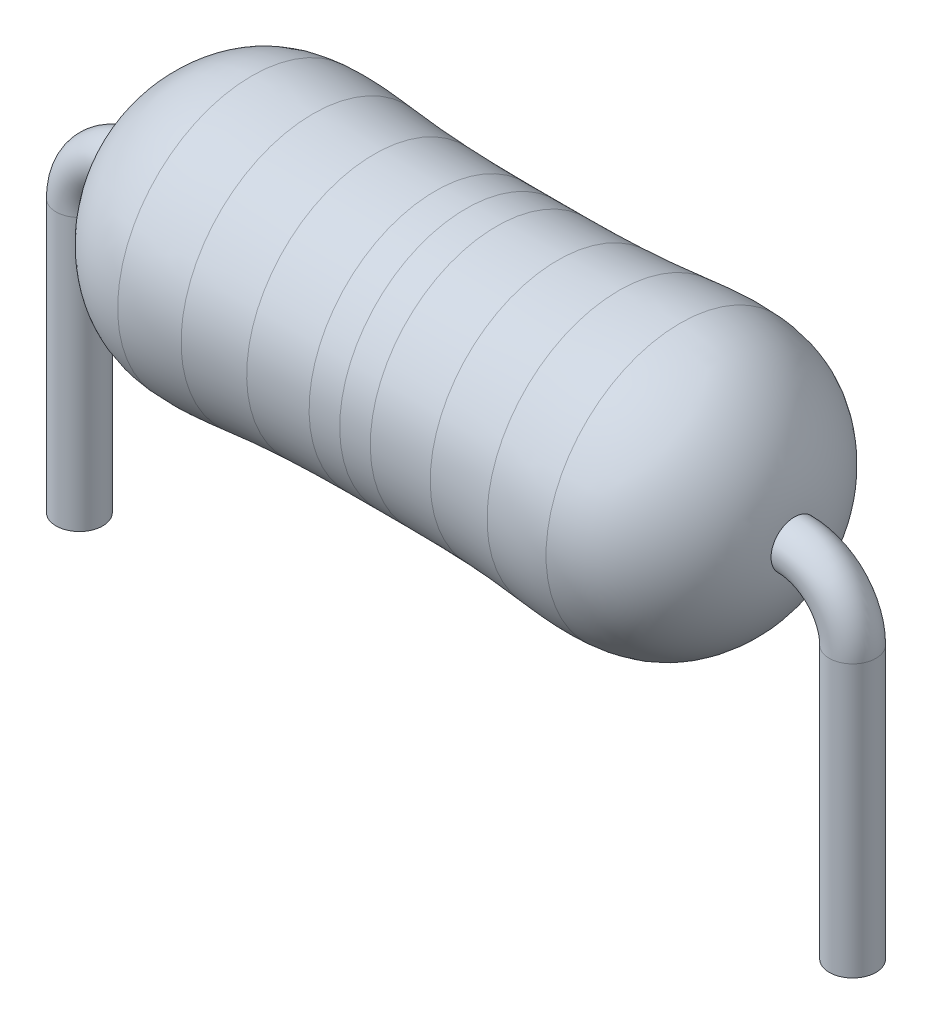
ISO-10303-21;
HEADER;
FILE_DESCRIPTION(('STEP AP214'),'2;1');
FILE_NAME('part.step','',(''),(''),'','','');
FILE_SCHEMA(('AUTOMOTIVE_DESIGN { 1 0 10303 214 1 1 1 1 }'));
ENDSEC;
DATA;
#1=APPLICATION_CONTEXT('core data for automotive mechanical design processes');
#2=APPLICATION_PROTOCOL_DEFINITION('international standard','automotive_design',2000,#1);
#3=PRODUCT_CONTEXT('',#1,'mechanical');
#4=PRODUCT('Part','Part','',(#3));
#5=PRODUCT_RELATED_PRODUCT_CATEGORY('part','',(#4));
#6=PRODUCT_DEFINITION_FORMATION('','',#4);
#7=PRODUCT_DEFINITION_CONTEXT('part definition',#1,'design');
#8=PRODUCT_DEFINITION('design','',#6,#7);
#9=PRODUCT_DEFINITION_SHAPE('','',#8);
#10=(LENGTH_UNIT() NAMED_UNIT(*) SI_UNIT(.MILLI.,.METRE.));
#11=(NAMED_UNIT(*) PLANE_ANGLE_UNIT() SI_UNIT($,.RADIAN.));
#12=(NAMED_UNIT(*) SI_UNIT($,.STERADIAN.) SOLID_ANGLE_UNIT());
#13=UNCERTAINTY_MEASURE_WITH_UNIT(LENGTH_MEASURE(1.E-05),#10,'distance_accuracy_value','');
#14=(GEOMETRIC_REPRESENTATION_CONTEXT(3) GLOBAL_UNCERTAINTY_ASSIGNED_CONTEXT((#13)) GLOBAL_UNIT_ASSIGNED_CONTEXT((#10,
#11,#12)) REPRESENTATION_CONTEXT('',''));
#15=CARTESIAN_POINT('',(0.,0.,0.));
#16=DIRECTION('',(0.,0.,1.));
#17=DIRECTION('',(1.,0.,0.));
#18=AXIS2_PLACEMENT_3D('',#15,#16,#17);
#19=CARTESIAN_POINT('',(0.762,1.778,0.));
#20=CARTESIAN_POINT('',(0.757798481162608,1.8794424331425,0.));
#21=CARTESIAN_POINT('',(0.731939999461414,2.50377553806516,0.));
#22=CARTESIAN_POINT('',(1.58171785802034,3.71232146915156,0.));
#23=CARTESIAN_POINT('',(3.36088257649651,3.42818239547803,0.));
#24=CARTESIAN_POINT('',(4.47917399306202,3.42872222585728,0.));
#25=CARTESIAN_POINT('',(5.0546,3.429,0.));
#26=B_SPLINE_CURVE_WITH_KNOTS('',3,(#19,#20,#21,#22,#23,#24,#25),.UNSPECIFIED.,.F.,.F.,(4,1,1,1,
4),(0.,0.0576904747940552,0.355059240367772,0.668140450217807,1.),.UNSPECIFIED.);
#27=CARTESIAN_POINT('',(0.762,1.778,0.));
#28=DIRECTION('',(-1.,0.,0.));
#29=AXIS1_PLACEMENT('',#27,#28);
#30=SURFACE_OF_REVOLUTION('',#26,#29);
#31=CARTESIAN_POINT('',(0.762,1.778,0.));
#32=DIRECTION('',(1.,0.,0.));
#33=DIRECTION('',(0.,0.,1.));
#34=AXIS2_PLACEMENT_3D('',#31,#32,#33);
#35=CIRCLE('',#34,0.3048);
#36=CARTESIAN_POINT('',(0.762,2.0828,0.));
#37=VERTEX_POINT('',#36);
#38=EDGE_CURVE('E63',#37,#37,#35,.T.);
#39=ORIENTED_EDGE('',*,*,#38,.T.);
#40=EDGE_LOOP('',(#39));
#41=FACE_BOUND('',#40,.T.);
#42=CARTESIAN_POINT('',(2.2546,1.778,0.));
#43=DIRECTION('',(-1.,0.,0.));
#44=DIRECTION('',(0.,-1.,0.));
#45=AXIS2_PLACEMENT_3D('',#42,#43,#44);
#46=CIRCLE('',#45,1.75368327505911);
#47=CARTESIAN_POINT('',(2.2546,0.0243167249408928,0.));
#48=VERTEX_POINT('',#47);
#49=EDGE_CURVE('E10',#48,#48,#46,.T.);
#50=ORIENTED_EDGE('',*,*,#49,.T.);
#51=EDGE_LOOP('',(#50));
#52=FACE_BOUND('',#51,.T.);
#53=ADVANCED_FACE('F35',(#41,#52),#30,.F.);
#54=CARTESIAN_POINT('',(3.8546,1.778,0.));
#55=DIRECTION('',(-1.,0.,0.));
#56=DIRECTION('',(0.,-1.,0.));
#57=AXIS2_PLACEMENT_3D('',#54,#55,#56);
#58=CIRCLE('',#57,1.66739616248276);
#59=CARTESIAN_POINT('',(3.8546,0.110603837517235,0.));
#60=VERTEX_POINT('',#59);
#61=EDGE_CURVE('E50',#60,#60,#58,.T.);
#62=ORIENTED_EDGE('',*,*,#61,.T.);
#63=EDGE_LOOP('',(#62));
#64=FACE_BOUND('',#63,.T.);
#65=CARTESIAN_POINT('',(3.0546,1.778,0.));
#66=DIRECTION('',(-1.,0.,0.));
#67=DIRECTION('',(0.,-1.,0.));
#68=AXIS2_PLACEMENT_3D('',#65,#66,#67);
#69=CIRCLE('',#68,1.72453972160211);
#70=CARTESIAN_POINT('',(3.0546,0.0534602783978902,0.));
#71=VERTEX_POINT('',#70);
#72=EDGE_CURVE('E43',#71,#71,#69,.F.);
#73=ORIENTED_EDGE('',*,*,#72,.T.);
#74=EDGE_LOOP('',(#73));
#75=FACE_BOUND('',#74,.T.);
#76=ADVANCED_FACE('F104',(#64,#75),#30,.F.);
#77=ORIENTED_EDGE('',*,*,#49,.F.);
#78=EDGE_LOOP('',(#77));
#79=FACE_BOUND('',#78,.T.);
#80=ORIENTED_EDGE('',*,*,#72,.F.);
#81=EDGE_LOOP('',(#80));
#82=FACE_BOUND('',#81,.T.);
#83=ADVANCED_FACE('F109',(#79,#82),#30,.F.);
#84=CARTESIAN_POINT('',(5.0546,1.778,0.));
#85=DIRECTION('',(-1.,0.,0.));
#86=DIRECTION('',(0.,-1.,0.));
#87=AXIS2_PLACEMENT_3D('',#84,#85,#86);
#88=CIRCLE('',#87,1.651);
#89=CARTESIAN_POINT('',(5.0546,0.127,0.));
#90=VERTEX_POINT('',#89);
#91=EDGE_CURVE('E127',#90,#90,#88,.T.);
#92=ORIENTED_EDGE('',*,*,#91,.T.);
#93=EDGE_LOOP('',(#92));
#94=FACE_BOUND('',#93,.T.);
#95=CARTESIAN_POINT('',(4.6546,1.778,0.));
#96=DIRECTION('',(-1.,0.,0.));
#97=DIRECTION('',(0.,-1.,0.));
#98=AXIS2_PLACEMENT_3D('',#95,#96,#97);
#99=CIRCLE('',#98,1.65144785309043);
#100=CARTESIAN_POINT('',(4.6546,0.126552146909569,0.));
#101=VERTEX_POINT('',#100);
#102=EDGE_CURVE('E57',#101,#101,#99,.F.);
#103=ORIENTED_EDGE('',*,*,#102,.T.);
#104=EDGE_LOOP('',(#103));
#105=FACE_BOUND('',#104,.T.);
#106=ADVANCED_FACE('F89',(#94,#105),#30,.F.);
#107=CARTESIAN_POINT('',(0.762,1.016,0.));
#108=DIRECTION('',(0.,0.,-1.));
#109=DIRECTION('',(-1.,0.,0.));
#110=AXIS2_PLACEMENT_3D('',#107,#108,#109);
#111=TOROIDAL_SURFACE('',#110,0.762,0.3048);
#112=CARTESIAN_POINT('',(0.,1.016,0.));
#113=DIRECTION('',(0.,1.,0.));
#114=DIRECTION('',(0.,0.,1.));
#115=AXIS2_PLACEMENT_3D('',#112,#113,#114);
#116=CIRCLE('',#115,0.3048);
#117=CARTESIAN_POINT('',(-0.3048,1.016,0.));
#118=VERTEX_POINT('',#117);
#119=EDGE_CURVE('E66',#118,#118,#116,.T.);
#120=CARTESIAN_POINT('',(0.762,1.016,0.));
#121=DIRECTION('',(0.,0.,-1.));
#122=DIRECTION('',(-1.,0.,0.));
#123=AXIS2_PLACEMENT_3D('',#120,#121,#122);
#124=CIRCLE('',#123,1.0668);
#125=EDGE_CURVE('',#118,#37,#124,.T.);
#126=ORIENTED_EDGE('',*,*,#119,.T.);
#127=ORIENTED_EDGE('',*,*,#38,.F.);
#128=ORIENTED_EDGE('',*,*,#125,.T.);
#129=ORIENTED_EDGE('',*,*,#125,.F.);
#130=EDGE_LOOP('',(#126,#128,#127,#129));
#131=FACE_BOUND('',#130,.T.);
#132=ADVANCED_FACE('F37',(#131),#111,.T.);
#133=CARTESIAN_POINT('',(0.,1.016,0.));
#134=DIRECTION('',(0.,-1.,0.));
#135=DIRECTION('',(0.,0.,-1.));
#136=AXIS2_PLACEMENT_3D('',#133,#134,#135);
#137=CYLINDRICAL_SURFACE('',#136,0.3048);
#138=ORIENTED_EDGE('',*,*,#119,.F.);
#139=EDGE_LOOP('',(#138));
#140=FACE_BOUND('',#139,.T.);
#141=CARTESIAN_POINT('',(0.,-2.54,0.));
#142=DIRECTION('',(0.,1.,0.));
#143=DIRECTION('',(0.,0.,1.));
#144=AXIS2_PLACEMENT_3D('',#141,#142,#143);
#145=CIRCLE('',#144,0.3048);
#146=CARTESIAN_POINT('',(0.,-2.54,0.3048));
#147=VERTEX_POINT('',#146);
#148=EDGE_CURVE('E67',#147,#147,#145,.T.);
#149=ORIENTED_EDGE('',*,*,#148,.T.);
#150=EDGE_LOOP('',(#149));
#151=FACE_BOUND('',#150,.T.);
#152=ADVANCED_FACE('F93',(#140,#151),#137,.T.);
#153=CARTESIAN_POINT('',(0.,-2.54,0.));
#154=DIRECTION('',(0.,1.,0.));
#155=DIRECTION('',(0.,0.,1.));
#156=AXIS2_PLACEMENT_3D('',#153,#154,#155);
#157=PLANE('',#156);
#158=ORIENTED_EDGE('',*,*,#148,.F.);
#159=EDGE_LOOP('',(#158));
#160=FACE_BOUND('',#159,.T.);
#161=ADVANCED_FACE('F87',(#160),#157,.F.);
#162=ORIENTED_EDGE('',*,*,#61,.F.);
#163=EDGE_LOOP('',(#162));
#164=FACE_BOUND('',#163,.T.);
#165=ORIENTED_EDGE('',*,*,#102,.F.);
#166=EDGE_LOOP('',(#165));
#167=FACE_BOUND('',#166,.T.);
#168=ADVANCED_FACE('F82',(#164,#167),#30,.F.);
#169=CARTESIAN_POINT('',(9.3472,1.778,0.));
#170=CARTESIAN_POINT('',(9.35140151883739,1.8794424331425,0.));
#171=CARTESIAN_POINT('',(9.37726000053859,2.50377553806516,0.));
#172=CARTESIAN_POINT('',(8.52748214197966,3.71232146915156,0.));
#173=CARTESIAN_POINT('',(6.74831742350349,3.42818239547803,0.));
#174=CARTESIAN_POINT('',(5.63002600693798,3.42872222585728,0.));
#175=CARTESIAN_POINT('',(5.0546,3.429,0.));
#176=B_SPLINE_CURVE_WITH_KNOTS('',3,(#169,#170,#171,#172,#173,#174,#175),.UNSPECIFIED.,.F.,.F.,
(4,1,1,1,4),(0.,0.0576904747940552,0.355059240367772,0.668140450217807,1.),.UNSPECIFIED.);
#177=CARTESIAN_POINT('',(9.3472,1.778,0.));
#178=DIRECTION('',(1.,0.,0.));
#179=AXIS1_PLACEMENT('',#177,#178);
#180=SURFACE_OF_REVOLUTION('',#176,#179);
#181=CARTESIAN_POINT('',(9.3472,1.778,0.));
#182=DIRECTION('',(1.,0.,0.));
#183=DIRECTION('',(0.,0.,1.));
#184=AXIS2_PLACEMENT_3D('',#181,#182,#183);
#185=CIRCLE('',#184,0.3048);
#186=CARTESIAN_POINT('',(9.3472,2.0828,0.));
#187=VERTEX_POINT('',#186);
#188=EDGE_CURVE('E140',#187,#187,#185,.T.);
#189=ORIENTED_EDGE('',*,*,#188,.F.);
#190=EDGE_LOOP('',(#189));
#191=FACE_BOUND('',#190,.T.);
#192=CARTESIAN_POINT('',(7.8546,1.778,0.));
#193=DIRECTION('',(-1.,0.,0.));
#194=DIRECTION('',(0.,-1.,0.));
#195=AXIS2_PLACEMENT_3D('',#192,#193,#194);
#196=CIRCLE('',#195,1.75368327505911);
#197=CARTESIAN_POINT('',(7.8546,0.0243167249408935,0.));
#198=VERTEX_POINT('',#197);
#199=EDGE_CURVE('E70',#198,#198,#196,.T.);
#200=ORIENTED_EDGE('',*,*,#199,.F.);
#201=EDGE_LOOP('',(#200));
#202=FACE_BOUND('',#201,.T.);
#203=ADVANCED_FACE('F86',(#191,#202),#180,.F.);
#204=CARTESIAN_POINT('',(6.2546,1.778,0.));
#205=DIRECTION('',(-1.,0.,0.));
#206=DIRECTION('',(0.,-1.,0.));
#207=AXIS2_PLACEMENT_3D('',#204,#205,#206);
#208=CIRCLE('',#207,1.66739616248276);
#209=CARTESIAN_POINT('',(6.2546,0.110603837517235,0.));
#210=VERTEX_POINT('',#209);
#211=EDGE_CURVE('E148',#210,#210,#208,.T.);
#212=ORIENTED_EDGE('',*,*,#211,.F.);
#213=EDGE_LOOP('',(#212));
#214=FACE_BOUND('',#213,.T.);
#215=CARTESIAN_POINT('',(7.0546,1.778,0.));
#216=DIRECTION('',(-1.,0.,0.));
#217=DIRECTION('',(0.,-1.,0.));
#218=AXIS2_PLACEMENT_3D('',#215,#216,#217);
#219=CIRCLE('',#218,1.72453972160211);
#220=CARTESIAN_POINT('',(7.0546,0.0534602783978906,0.));
#221=VERTEX_POINT('',#220);
#222=EDGE_CURVE('E151',#221,#221,#219,.F.);
#223=ORIENTED_EDGE('',*,*,#222,.F.);
#224=EDGE_LOOP('',(#223));
#225=FACE_BOUND('',#224,.T.);
#226=ADVANCED_FACE('F167',(#214,#225),#180,.F.);
#227=ORIENTED_EDGE('',*,*,#199,.T.);
#228=EDGE_LOOP('',(#227));
#229=FACE_BOUND('',#228,.T.);
#230=ORIENTED_EDGE('',*,*,#222,.T.);
#231=EDGE_LOOP('',(#230));
#232=FACE_BOUND('',#231,.T.);
#233=ADVANCED_FACE('F164',(#229,#232),#180,.F.);
#234=ORIENTED_EDGE('',*,*,#91,.F.);
#235=EDGE_LOOP('',(#234));
#236=FACE_BOUND('',#235,.T.);
#237=CARTESIAN_POINT('',(5.4546,1.778,0.));
#238=DIRECTION('',(-1.,0.,0.));
#239=DIRECTION('',(0.,-1.,0.));
#240=AXIS2_PLACEMENT_3D('',#237,#238,#239);
#241=CIRCLE('',#240,1.65144785309043);
#242=CARTESIAN_POINT('',(5.4546,0.126552146909569,0.));
#243=VERTEX_POINT('',#242);
#244=EDGE_CURVE('E144',#243,#243,#241,.F.);
#245=ORIENTED_EDGE('',*,*,#244,.F.);
#246=EDGE_LOOP('',(#245));
#247=FACE_BOUND('',#246,.T.);
#248=ADVANCED_FACE('F180',(#236,#247),#180,.F.);
#249=CARTESIAN_POINT('',(9.3472,1.016,0.));
#250=DIRECTION('',(0.,0.,-1.));
#251=DIRECTION('',(1.,0.,0.));
#252=AXIS2_PLACEMENT_3D('',#249,#250,#251);
#253=TOROIDAL_SURFACE('',#252,0.762,0.3048);
#254=CARTESIAN_POINT('',(10.1092,1.016,0.));
#255=DIRECTION('',(0.,-1.,0.));
#256=DIRECTION('',(0.,0.,1.));
#257=AXIS2_PLACEMENT_3D('',#254,#255,#256);
#258=CIRCLE('',#257,0.3048);
#259=CARTESIAN_POINT('',(10.414,1.016,0.));
#260=VERTEX_POINT('',#259);
#261=EDGE_CURVE('E132',#260,#260,#258,.T.);
#262=CARTESIAN_POINT('',(9.3472,1.016,0.));
#263=DIRECTION('',(0.,0.,-1.));
#264=DIRECTION('',(1.,0.,0.));
#265=AXIS2_PLACEMENT_3D('',#262,#263,#264);
#266=CIRCLE('',#265,1.0668);
#267=EDGE_CURVE('',#187,#260,#266,.T.);
#268=ORIENTED_EDGE('',*,*,#188,.T.);
#269=ORIENTED_EDGE('',*,*,#261,.F.);
#270=ORIENTED_EDGE('',*,*,#267,.T.);
#271=ORIENTED_EDGE('',*,*,#267,.F.);
#272=EDGE_LOOP('',(#268,#270,#269,#271));
#273=FACE_BOUND('',#272,.T.);
#274=ADVANCED_FACE('F90',(#273),#253,.T.);
#275=CARTESIAN_POINT('',(10.1092,1.016,0.));
#276=DIRECTION('',(0.,-1.,0.));
#277=DIRECTION('',(0.,0.,-1.));
#278=AXIS2_PLACEMENT_3D('',#275,#276,#277);
#279=CYLINDRICAL_SURFACE('',#278,0.3048);
#280=ORIENTED_EDGE('',*,*,#261,.T.);
#281=EDGE_LOOP('',(#280));
#282=FACE_BOUND('',#281,.T.);
#283=CARTESIAN_POINT('',(10.1092,-2.54,0.));
#284=DIRECTION('',(0.,-1.,0.));
#285=DIRECTION('',(0.,0.,1.));
#286=AXIS2_PLACEMENT_3D('',#283,#284,#285);
#287=CIRCLE('',#286,0.3048);
#288=CARTESIAN_POINT('',(10.1092,-2.54,0.3048));
#289=VERTEX_POINT('',#288);
#290=EDGE_CURVE('E129',#289,#289,#287,.T.);
#291=ORIENTED_EDGE('',*,*,#290,.F.);
#292=EDGE_LOOP('',(#291));
#293=FACE_BOUND('',#292,.T.);
#294=ADVANCED_FACE('F184',(#282,#293),#279,.T.);
#295=CARTESIAN_POINT('',(10.1092,-2.54,0.));
#296=DIRECTION('',(0.,1.,0.));
#297=DIRECTION('',(0.,0.,1.));
#298=AXIS2_PLACEMENT_3D('',#295,#296,#297);
#299=PLANE('',#298);
#300=ORIENTED_EDGE('',*,*,#290,.T.);
#301=EDGE_LOOP('',(#300));
#302=FACE_BOUND('',#301,.T.);
#303=ADVANCED_FACE('F178',(#302),#299,.F.);
#304=ORIENTED_EDGE('',*,*,#211,.T.);
#305=EDGE_LOOP('',(#304));
#306=FACE_BOUND('',#305,.T.);
#307=ORIENTED_EDGE('',*,*,#244,.T.);
#308=EDGE_LOOP('',(#307));
#309=FACE_BOUND('',#308,.T.);
#310=ADVANCED_FACE('F170',(#306,#309),#180,.F.);
#311=CLOSED_SHELL('',(#53,#76,#83,#106,#132,#152,#161,#168,#203,#226,#233,#248,#274,#294,#303,#310));
#312=MANIFOLD_SOLID_BREP('B2',#311);
#313=ADVANCED_BREP_SHAPE_REPRESENTATION('',(#18,#312),#14);
#314=SHAPE_DEFINITION_REPRESENTATION(#9,#313);
ENDSEC;
END-ISO-10303-21;
